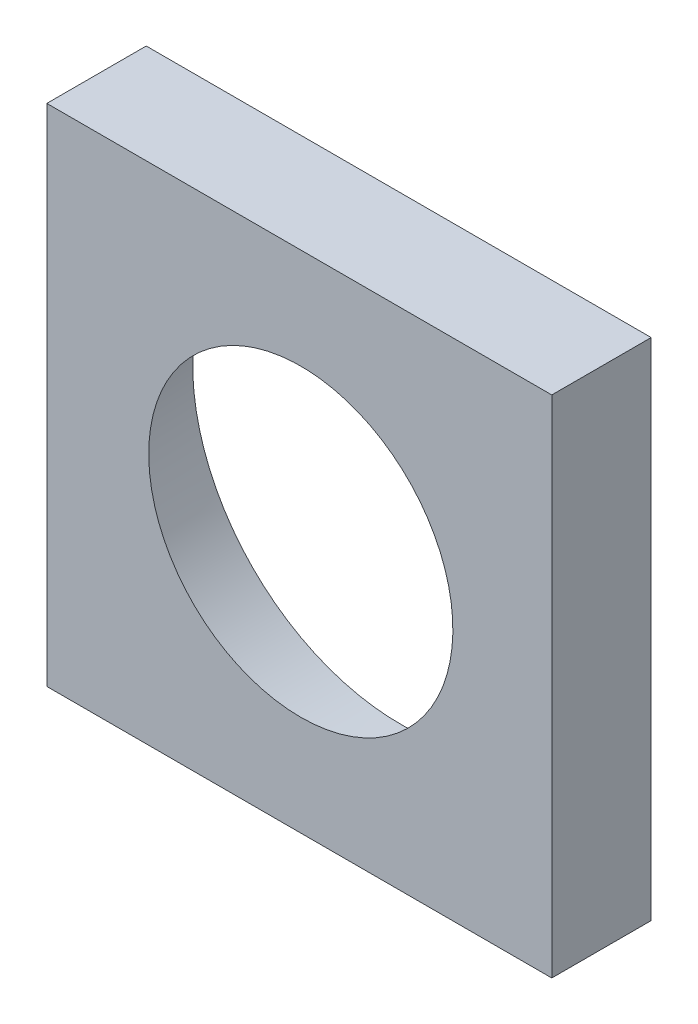
ISO-10303-21;
HEADER;
FILE_DESCRIPTION(('STEP AP214'),'2;1');
FILE_NAME('part.step','',(''),(''),'','','');
FILE_SCHEMA(('AUTOMOTIVE_DESIGN { 1 0 10303 214 1 1 1 1 }'));
ENDSEC;
DATA;
#1=APPLICATION_CONTEXT('core data for automotive mechanical design processes');
#2=APPLICATION_PROTOCOL_DEFINITION('international standard','automotive_design',2000,#1);
#3=PRODUCT_CONTEXT('',#1,'mechanical');
#4=PRODUCT('Part','Part','',(#3));
#5=PRODUCT_RELATED_PRODUCT_CATEGORY('part','',(#4));
#6=PRODUCT_DEFINITION_FORMATION('','',#4);
#7=PRODUCT_DEFINITION_CONTEXT('part definition',#1,'design');
#8=PRODUCT_DEFINITION('design','',#6,#7);
#9=PRODUCT_DEFINITION_SHAPE('','',#8);
#10=(LENGTH_UNIT() NAMED_UNIT(*) SI_UNIT(.MILLI.,.METRE.));
#11=(NAMED_UNIT(*) PLANE_ANGLE_UNIT() SI_UNIT($,.RADIAN.));
#12=(NAMED_UNIT(*) SI_UNIT($,.STERADIAN.) SOLID_ANGLE_UNIT());
#13=UNCERTAINTY_MEASURE_WITH_UNIT(LENGTH_MEASURE(1.E-05),#10,'distance_accuracy_value','');
#14=(GEOMETRIC_REPRESENTATION_CONTEXT(3) GLOBAL_UNCERTAINTY_ASSIGNED_CONTEXT((#13)) GLOBAL_UNIT_ASSIGNED_CONTEXT((#10,
#11,#12)) REPRESENTATION_CONTEXT('',''));
#15=CARTESIAN_POINT('',(0.,0.,0.));
#16=DIRECTION('',(0.,0.,1.));
#17=DIRECTION('',(1.,0.,0.));
#18=AXIS2_PLACEMENT_3D('',#15,#16,#17);
#19=CARTESIAN_POINT('',(0.,-2.43573640629004E-13,67.1329433698925));
#20=DIRECTION('',(0.,0.,1.));
#21=DIRECTION('',(1.,0.,0.));
#22=AXIS2_PLACEMENT_3D('',#19,#20,#21);
#23=PLANE('',#22);
#24=CARTESIAN_POINT('',(0.908695261639877,-0.0776127525779172,67.1329433698925));
#25=DIRECTION('',(0.,0.,1.));
#26=DIRECTION('',(1.,0.,0.));
#27=AXIS2_PLACEMENT_3D('',#24,#25,#26);
#28=CIRCLE('',#27,125.28603319766);
#29=CARTESIAN_POINT('',(126.1947284593,-0.0776127525779172,67.1329433698925));
#30=VERTEX_POINT('',#29);
#31=EDGE_CURVE('E11',#30,#30,#28,.T.);
#32=ORIENTED_EDGE('',*,*,#31,.T.);
#33=EDGE_LOOP('',(#32));
#34=FACE_BOUND('',#33,.T.);
#35=DIRECTION('',(0.,-1.,0.));
#36=VECTOR('',#35,1.);
#37=CARTESIAN_POINT('',(-152.4,152.4,67.1329433698925));
#38=LINE('',#37,#36);
#39=CARTESIAN_POINT('',(-152.4,152.4,67.1329433698925));
#40=VERTEX_POINT('',#39);
#41=CARTESIAN_POINT('',(-152.4,-152.4,67.1329433698925));
#42=VERTEX_POINT('',#41);
#43=EDGE_CURVE('E109',#40,#42,#38,.T.);
#44=ORIENTED_EDGE('',*,*,#43,.F.);
#45=DIRECTION('',(-1.,0.,0.));
#46=VECTOR('',#45,1.);
#47=CARTESIAN_POINT('',(152.4,152.4,67.1329433698925));
#48=LINE('',#47,#46);
#49=CARTESIAN_POINT('',(152.4,152.4,67.1329433698925));
#50=VERTEX_POINT('',#49);
#51=EDGE_CURVE('E80',#50,#40,#48,.T.);
#52=ORIENTED_EDGE('',*,*,#51,.F.);
#53=DIRECTION('',(0.,1.,0.));
#54=VECTOR('',#53,1.);
#55=CARTESIAN_POINT('',(152.4,152.4,67.1329433698925));
#56=LINE('',#55,#54);
#57=CARTESIAN_POINT('',(152.4,-152.4,67.1329433698925));
#58=VERTEX_POINT('',#57);
#59=EDGE_CURVE('E111',#58,#50,#56,.T.);
#60=ORIENTED_EDGE('',*,*,#59,.F.);
#61=DIRECTION('',(1.,0.,0.));
#62=VECTOR('',#61,1.);
#63=CARTESIAN_POINT('',(152.4,-152.4,67.1329433698925));
#64=LINE('',#63,#62);
#65=EDGE_CURVE('E39',#42,#58,#64,.T.);
#66=ORIENTED_EDGE('',*,*,#65,.F.);
#67=EDGE_LOOP('',(#44,#52,#60,#66));
#68=FACE_BOUND('',#67,.T.);
#69=ADVANCED_FACE('F32',(#34,#68),#23,.F.);
#70=CARTESIAN_POINT('',(0.90869526163995,-0.077612752578179,116.353347557886));
#71=DIRECTION('',(0.,0.,-1.));
#72=DIRECTION('',(0.,1.,0.));
#73=AXIS2_PLACEMENT_3D('',#70,#71,#72);
#74=CONICAL_SURFACE('',#73,119.056955539065,1.13331210913777);
#75=CARTESIAN_POINT('',(0.90869526163995,-0.0776127525782104,125.348106712939));
#76=DIRECTION('',(0.,0.,1.));
#77=DIRECTION('',(0.,-1.,0.));
#78=AXIS2_PLACEMENT_3D('',#75,#76,#77);
#79=CIRCLE('',#78,99.8255002525088);
#80=CARTESIAN_POINT('',(0.90869526163995,-99.903113005087,125.348106712939));
#81=VERTEX_POINT('',#80);
#82=EDGE_CURVE('E99',#81,#81,#79,.T.);
#83=ORIENTED_EDGE('',*,*,#82,.T.);
#84=EDGE_LOOP('',(#83));
#85=FACE_BOUND('',#84,.T.);
#86=CARTESIAN_POINT('',(0.90869526163995,-0.077612752578179,116.353347557886));
#87=DIRECTION('',(0.,0.,1.));
#88=DIRECTION('',(0.,-1.,0.));
#89=AXIS2_PLACEMENT_3D('',#86,#87,#88);
#90=CIRCLE('',#89,119.056955539065);
#91=CARTESIAN_POINT('',(0.90869526163995,-119.134568291643,116.353347557886));
#92=VERTEX_POINT('',#91);
#93=EDGE_CURVE('E157',#92,#92,#90,.T.);
#94=ORIENTED_EDGE('',*,*,#93,.F.);
#95=EDGE_LOOP('',(#94));
#96=FACE_BOUND('',#95,.T.);
#97=ADVANCED_FACE('F131',(#85,#96),#74,.F.);
#98=CARTESIAN_POINT('',(0.90869526163995,-0.0776127525781537,109.10678459855));
#99=DIRECTION('',(0.,0.,1.));
#100=DIRECTION('',(0.,-1.,0.));
#101=AXIS2_PLACEMENT_3D('',#98,#99,#100);
#102=TOROIDAL_SURFACE('',#101,115.667659848753,8.);
#103=ORIENTED_EDGE('',*,*,#93,.T.);
#104=EDGE_LOOP('',(#103));
#105=FACE_BOUND('',#104,.T.);
#106=CARTESIAN_POINT('',(0.90869526163995,-0.0776127525781548,109.41388707125));
#107=DIRECTION('',(0.,0.,1.));
#108=DIRECTION('',(0.,-1.,0.));
#109=AXIS2_PLACEMENT_3D('',#106,#107,#108);
#110=CIRCLE('',#109,123.661763180038);
#111=CARTESIAN_POINT('',(0.90869526163995,-123.739375932616,109.413887071249));
#112=VERTEX_POINT('',#111);
#113=EDGE_CURVE('E151',#112,#112,#110,.T.);
#114=ORIENTED_EDGE('',*,*,#113,.F.);
#115=EDGE_LOOP('',(#114));
#116=FACE_BOUND('',#115,.T.);
#117=ADVANCED_FACE('F137',(#105,#116),#102,.F.);
#118=CARTESIAN_POINT('',(0.90869526163995,-0.0776127525779172,41.3463400319306));
#119=DIRECTION('',(0.,0.,-1.));
#120=DIRECTION('',(0.,1.,0.));
#121=AXIS2_PLACEMENT_3D('',#118,#119,#120);
#122=CONICAL_SURFACE('',#121,126.276654574374,0.0383972435438753);
#123=ORIENTED_EDGE('',*,*,#31,.F.);
#124=EDGE_LOOP('',(#123));
#125=FACE_BOUND('',#124,.T.);
#126=ORIENTED_EDGE('',*,*,#113,.T.);
#127=EDGE_LOOP('',(#126));
#128=FACE_BOUND('',#127,.T.);
#129=ADVANCED_FACE('F125',(#125,#128),#122,.F.);
#130=CARTESIAN_POINT('',(0.90869526163995,-91.876387752581,127.132943369892));
#131=CARTESIAN_POINT('',(0.90869526163995,-94.6834634015012,127.132943369892));
#132=CARTESIAN_POINT('',(0.90869526163995,-97.40004583746,126.518818236651));
#133=CARTESIAN_POINT('',(0.90869526163995,-99.903113005087,125.348106712939));
#134=(BOUNDED_CURVE() B_SPLINE_CURVE(3,(#130,#131,#132,#133),.UNSPECIFIED.,.F.,
.F.) B_SPLINE_CURVE_WITH_KNOTS((4,4),(0.,1.),
.UNSPECIFIED.) CURVE() GEOMETRIC_REPRESENTATION_ITEM() RATIONAL_B_SPLINE_CURVE((0.254333095030252,
0.254333095030252,0.258499793724843,0.266833191114025)) REPRESENTATION_ITEM(''));
#135=CARTESIAN_POINT('',(0.90869526163995,-0.0776127525783632,169.085651996013));
#136=DIRECTION('',(0.,0.,1.));
#137=AXIS1_PLACEMENT('',#135,#136);
#138=SURFACE_OF_REVOLUTION('',#134,#137);
#139=ORIENTED_EDGE('',*,*,#82,.F.);
#140=EDGE_LOOP('',(#139));
#141=FACE_BOUND('',#140,.T.);
#142=CARTESIAN_POINT('',(0.90869526163995,-0.0776127525782167,127.132943369893));
#143=DIRECTION('',(0.,0.,1.));
#144=DIRECTION('',(0.,-1.,0.));
#145=AXIS2_PLACEMENT_3D('',#142,#143,#144);
#146=CIRCLE('',#145,91.7987750000028);
#147=CARTESIAN_POINT('',(0.90869526163995,-91.876387752581,127.132943369892));
#148=VERTEX_POINT('',#147);
#149=EDGE_CURVE('E94',#148,#148,#146,.T.);
#150=ORIENTED_EDGE('',*,*,#149,.T.);
#151=EDGE_LOOP('',(#150));
#152=FACE_BOUND('',#151,.T.);
#153=ADVANCED_FACE('F116',(#141,#152),#138,.T.);
#154=CARTESIAN_POINT('',(152.4,-152.4,228.6));
#155=DIRECTION('',(0.,1.,0.));
#156=DIRECTION('',(-1.,0.,0.));
#157=AXIS2_PLACEMENT_3D('',#154,#155,#156);
#158=PLANE('',#157);
#159=DIRECTION('',(0.,0.,-1.));
#160=VECTOR('',#159,1.);
#161=CARTESIAN_POINT('',(-152.4,-152.4,228.6));
#162=LINE('',#161,#160);
#163=CARTESIAN_POINT('',(-152.4,-152.4,127.132943369892));
#164=VERTEX_POINT('',#163);
#165=EDGE_CURVE('E76',#164,#42,#162,.T.);
#166=ORIENTED_EDGE('',*,*,#165,.T.);
#167=ORIENTED_EDGE('',*,*,#65,.T.);
#168=DIRECTION('',(0.,0.,-1.));
#169=VECTOR('',#168,1.);
#170=CARTESIAN_POINT('',(152.4,-152.4,228.6));
#171=LINE('',#170,#169);
#172=CARTESIAN_POINT('',(152.4,-152.4,127.132943369893));
#173=VERTEX_POINT('',#172);
#174=EDGE_CURVE('E96',#173,#58,#171,.T.);
#175=ORIENTED_EDGE('',*,*,#174,.F.);
#176=DIRECTION('',(-1.,0.,0.));
#177=VECTOR('',#176,1.);
#178=CARTESIAN_POINT('',(152.4,-152.4,127.132943369892));
#179=LINE('',#178,#177);
#180=EDGE_CURVE('E81',#173,#164,#179,.T.);
#181=ORIENTED_EDGE('',*,*,#180,.T.);
#182=EDGE_LOOP('',(#166,#167,#175,#181));
#183=FACE_BOUND('',#182,.T.);
#184=ADVANCED_FACE('F114',(#183),#158,.F.);
#185=CARTESIAN_POINT('',(0.,-4.61267334725164E-13,127.132943369893));
#186=DIRECTION('',(0.,0.,-1.));
#187=DIRECTION('',(0.,1.,0.));
#188=AXIS2_PLACEMENT_3D('',#185,#186,#187);
#189=PLANE('',#188);
#190=ORIENTED_EDGE('',*,*,#149,.F.);
#191=EDGE_LOOP('',(#190));
#192=FACE_BOUND('',#191,.T.);
#193=ORIENTED_EDGE('',*,*,#180,.F.);
#194=DIRECTION('',(0.,-1.,0.));
#195=VECTOR('',#194,1.);
#196=CARTESIAN_POINT('',(152.4,152.4,127.132943369893));
#197=LINE('',#196,#195);
#198=CARTESIAN_POINT('',(152.4,152.4,127.132943369893));
#199=VERTEX_POINT('',#198);
#200=EDGE_CURVE('E86',#199,#173,#197,.T.);
#201=ORIENTED_EDGE('',*,*,#200,.F.);
#202=DIRECTION('',(1.,0.,0.));
#203=VECTOR('',#202,1.);
#204=CARTESIAN_POINT('',(152.4,152.4,127.132943369893));
#205=LINE('',#204,#203);
#206=CARTESIAN_POINT('',(-152.4,152.4,127.132943369893));
#207=VERTEX_POINT('',#206);
#208=EDGE_CURVE('E84',#207,#199,#205,.T.);
#209=ORIENTED_EDGE('',*,*,#208,.F.);
#210=DIRECTION('',(0.,1.,0.));
#211=VECTOR('',#210,1.);
#212=CARTESIAN_POINT('',(-152.4,152.4,127.132943369893));
#213=LINE('',#212,#211);
#214=EDGE_CURVE('E71',#164,#207,#213,.T.);
#215=ORIENTED_EDGE('',*,*,#214,.F.);
#216=EDGE_LOOP('',(#193,#201,#209,#215));
#217=FACE_BOUND('',#216,.T.);
#218=ADVANCED_FACE('F85',(#192,#217),#189,.F.);
#219=CARTESIAN_POINT('',(-152.4,152.4,228.6));
#220=DIRECTION('',(1.,0.,0.));
#221=DIRECTION('',(0.,1.,0.));
#222=AXIS2_PLACEMENT_3D('',#219,#220,#221);
#223=PLANE('',#222);
#224=DIRECTION('',(0.,0.,-1.));
#225=VECTOR('',#224,1.);
#226=CARTESIAN_POINT('',(-152.4,152.4,228.6));
#227=LINE('',#226,#225);
#228=EDGE_CURVE('E75',#207,#40,#227,.T.);
#229=ORIENTED_EDGE('',*,*,#228,.T.);
#230=ORIENTED_EDGE('',*,*,#43,.T.);
#231=ORIENTED_EDGE('',*,*,#165,.F.);
#232=ORIENTED_EDGE('',*,*,#214,.T.);
#233=EDGE_LOOP('',(#229,#230,#231,#232));
#234=FACE_BOUND('',#233,.T.);
#235=ADVANCED_FACE('F73',(#234),#223,.F.);
#236=CARTESIAN_POINT('',(152.4,152.4,228.6));
#237=DIRECTION('',(-1.,0.,0.));
#238=DIRECTION('',(0.,-1.,0.));
#239=AXIS2_PLACEMENT_3D('',#236,#237,#238);
#240=PLANE('',#239);
#241=ORIENTED_EDGE('',*,*,#174,.T.);
#242=ORIENTED_EDGE('',*,*,#59,.T.);
#243=DIRECTION('',(0.,0.,-1.));
#244=VECTOR('',#243,1.);
#245=CARTESIAN_POINT('',(152.4,152.4,228.6));
#246=LINE('',#245,#244);
#247=EDGE_CURVE('E93',#199,#50,#246,.T.);
#248=ORIENTED_EDGE('',*,*,#247,.F.);
#249=ORIENTED_EDGE('',*,*,#200,.T.);
#250=EDGE_LOOP('',(#241,#242,#248,#249));
#251=FACE_BOUND('',#250,.T.);
#252=ADVANCED_FACE('F113',(#251),#240,.F.);
#253=CARTESIAN_POINT('',(152.4,152.4,228.6));
#254=DIRECTION('',(0.,-1.,0.));
#255=DIRECTION('',(1.,0.,0.));
#256=AXIS2_PLACEMENT_3D('',#253,#254,#255);
#257=PLANE('',#256);
#258=ORIENTED_EDGE('',*,*,#247,.T.);
#259=ORIENTED_EDGE('',*,*,#51,.T.);
#260=ORIENTED_EDGE('',*,*,#228,.F.);
#261=ORIENTED_EDGE('',*,*,#208,.T.);
#262=EDGE_LOOP('',(#258,#259,#260,#261));
#263=FACE_BOUND('',#262,.T.);
#264=ADVANCED_FACE('F91',(#263),#257,.F.);
#265=CLOSED_SHELL('',(#69,#97,#117,#129,#153,#184,#218,#235,#252,#264));
#266=MANIFOLD_SOLID_BREP('B2',#265);
#267=ADVANCED_BREP_SHAPE_REPRESENTATION('',(#18,#266),#14);
#268=SHAPE_DEFINITION_REPRESENTATION(#9,#267);
ENDSEC;
END-ISO-10303-21;
